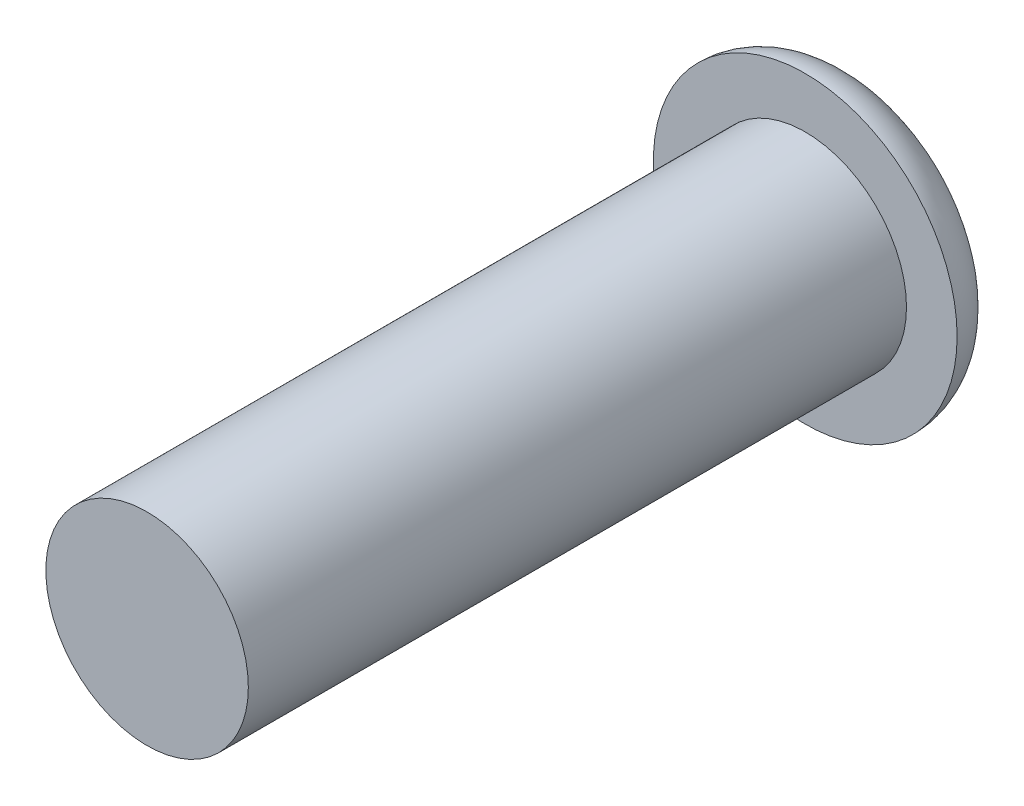
ISO-10303-21;
HEADER;
FILE_DESCRIPTION(('STEP AP214'),'2;1');
FILE_NAME('part.step','',(''),(''),'','','');
FILE_SCHEMA(('AUTOMOTIVE_DESIGN { 1 0 10303 214 1 1 1 1 }'));
ENDSEC;
DATA;
#1=APPLICATION_CONTEXT('core data for automotive mechanical design processes');
#2=APPLICATION_PROTOCOL_DEFINITION('international standard','automotive_design',2000,#1);
#3=PRODUCT_CONTEXT('',#1,'mechanical');
#4=PRODUCT('Part','Part','',(#3));
#5=PRODUCT_RELATED_PRODUCT_CATEGORY('part','',(#4));
#6=PRODUCT_DEFINITION_FORMATION('','',#4);
#7=PRODUCT_DEFINITION_CONTEXT('part definition',#1,'design');
#8=PRODUCT_DEFINITION('design','',#6,#7);
#9=PRODUCT_DEFINITION_SHAPE('','',#8);
#10=(LENGTH_UNIT() NAMED_UNIT(*) SI_UNIT(.MILLI.,.METRE.));
#11=(NAMED_UNIT(*) PLANE_ANGLE_UNIT() SI_UNIT($,.RADIAN.));
#12=(NAMED_UNIT(*) SI_UNIT($,.STERADIAN.) SOLID_ANGLE_UNIT());
#13=UNCERTAINTY_MEASURE_WITH_UNIT(LENGTH_MEASURE(1.E-05),#10,'distance_accuracy_value','');
#14=(GEOMETRIC_REPRESENTATION_CONTEXT(3) GLOBAL_UNCERTAINTY_ASSIGNED_CONTEXT((#13)) GLOBAL_UNIT_ASSIGNED_CONTEXT((#10,
#11,#12)) REPRESENTATION_CONTEXT('',''));
#15=CARTESIAN_POINT('',(0.,0.,0.));
#16=DIRECTION('',(0.,0.,1.));
#17=DIRECTION('',(1.,0.,0.));
#18=AXIS2_PLACEMENT_3D('',#15,#16,#17);
#19=CARTESIAN_POINT('',(0.,0.,5.));
#20=DIRECTION('',(0.,0.,1.));
#21=DIRECTION('',(1.,0.,0.));
#22=AXIS2_PLACEMENT_3D('',#19,#20,#21);
#23=PLANE('',#22);
#24=CARTESIAN_POINT('',(0.,0.,5.));
#25=DIRECTION('',(0.,0.,1.));
#26=DIRECTION('',(1.,0.,0.));
#27=AXIS2_PLACEMENT_3D('',#24,#25,#26);
#28=CIRCLE('',#27,10.);
#29=CARTESIAN_POINT('',(10.,0.,5.));
#30=VERTEX_POINT('',#29);
#31=EDGE_CURVE('E45',#30,#30,#28,.T.);
#32=ORIENTED_EDGE('',*,*,#31,.F.);
#33=EDGE_LOOP('',(#32));
#34=FACE_BOUND('',#33,.T.);
#35=CARTESIAN_POINT('',(0.,0.,5.));
#36=DIRECTION('',(0.,0.,1.));
#37=DIRECTION('',(1.,0.,0.));
#38=AXIS2_PLACEMENT_3D('',#35,#36,#37);
#39=CIRCLE('',#38,15.);
#40=CARTESIAN_POINT('',(15.,0.,5.));
#41=VERTEX_POINT('',#40);
#42=EDGE_CURVE('E50',#41,#41,#39,.T.);
#43=ORIENTED_EDGE('',*,*,#42,.T.);
#44=EDGE_LOOP('',(#43));
#45=FACE_BOUND('',#44,.T.);
#46=ADVANCED_FACE('F37',(#34,#45),#23,.T.);
#47=CARTESIAN_POINT('',(0.,0.,0.));
#48=DIRECTION('',(0.,0.,1.));
#49=DIRECTION('',(1.,0.,0.));
#50=AXIS2_PLACEMENT_3D('',#47,#48,#49);
#51=PLANE('',#50);
#52=CARTESIAN_POINT('',(0.,0.,0.));
#53=DIRECTION('',(0.,0.,1.));
#54=DIRECTION('',(1.,0.,0.));
#55=AXIS2_PLACEMENT_3D('',#52,#53,#54);
#56=CIRCLE('',#55,10.);
#57=CARTESIAN_POINT('',(10.,0.,0.));
#58=VERTEX_POINT('',#57);
#59=EDGE_CURVE('E10',#58,#58,#56,.F.);
#60=ORIENTED_EDGE('',*,*,#59,.T.);
#61=EDGE_LOOP('',(#60));
#62=FACE_BOUND('',#61,.T.);
#63=ADVANCED_FACE('F66',(#62),#51,.F.);
#64=CARTESIAN_POINT('',(0.,0.,70.));
#65=DIRECTION('',(0.,0.,-1.));
#66=DIRECTION('',(-1.,0.,0.));
#67=AXIS2_PLACEMENT_3D('',#64,#65,#66);
#68=CYLINDRICAL_SURFACE('',#67,10.);
#69=CARTESIAN_POINT('',(0.,0.,70.));
#70=DIRECTION('',(0.,0.,1.));
#71=DIRECTION('',(1.,0.,0.));
#72=AXIS2_PLACEMENT_3D('',#69,#70,#71);
#73=CIRCLE('',#72,10.);
#74=CARTESIAN_POINT('',(10.,0.,70.));
#75=VERTEX_POINT('',#74);
#76=EDGE_CURVE('E56',#75,#75,#73,.T.);
#77=ORIENTED_EDGE('',*,*,#76,.F.);
#78=EDGE_LOOP('',(#77));
#79=FACE_BOUND('',#78,.T.);
#80=ORIENTED_EDGE('',*,*,#31,.T.);
#81=EDGE_LOOP('',(#80));
#82=FACE_BOUND('',#81,.T.);
#83=ADVANCED_FACE('F64',(#79,#82),#68,.T.);
#84=CARTESIAN_POINT('',(0.,0.,70.));
#85=DIRECTION('',(0.,0.,1.));
#86=DIRECTION('',(1.,0.,0.));
#87=AXIS2_PLACEMENT_3D('',#84,#85,#86);
#88=PLANE('',#87);
#89=ORIENTED_EDGE('',*,*,#76,.T.);
#90=EDGE_LOOP('',(#89));
#91=FACE_BOUND('',#90,.T.);
#92=ADVANCED_FACE('F62',(#91),#88,.T.);
#93=CARTESIAN_POINT('',(0.,0.,5.));
#94=DIRECTION('',(0.,0.,1.));
#95=DIRECTION('',(1.,0.,0.));
#96=AXIS2_PLACEMENT_3D('',#93,#94,#95);
#97=TOROIDAL_SURFACE('',#96,10.,5.);
#98=ORIENTED_EDGE('',*,*,#59,.F.);
#99=EDGE_LOOP('',(#98));
#100=FACE_BOUND('',#99,.T.);
#101=ORIENTED_EDGE('',*,*,#42,.F.);
#102=EDGE_LOOP('',(#101));
#103=FACE_BOUND('',#102,.T.);
#104=ADVANCED_FACE('F39',(#100,#103),#97,.T.);
#105=CLOSED_SHELL('',(#46,#63,#83,#92,#104));
#106=MANIFOLD_SOLID_BREP('B2',#105);
#107=ADVANCED_BREP_SHAPE_REPRESENTATION('',(#18,#106),#14);
#108=SHAPE_DEFINITION_REPRESENTATION(#9,#107);
ENDSEC;
END-ISO-10303-21;
